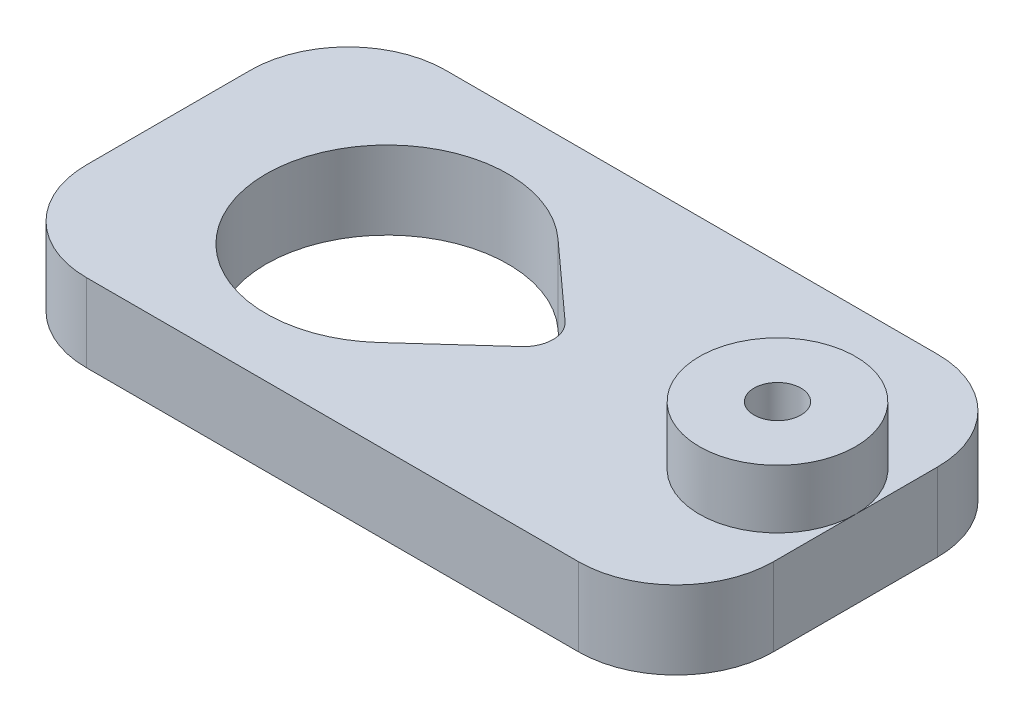
ISO-10303-21;
HEADER;
FILE_DESCRIPTION(('STEP AP214'),'2;1');
FILE_NAME('part.step','',(''),(''),'','','');
FILE_SCHEMA(('AUTOMOTIVE_DESIGN { 1 0 10303 214 1 1 1 1 }'));
ENDSEC;
DATA;
#1=APPLICATION_CONTEXT('core data for automotive mechanical design processes');
#2=APPLICATION_PROTOCOL_DEFINITION('international standard','automotive_design',2000,#1);
#3=PRODUCT_CONTEXT('',#1,'mechanical');
#4=PRODUCT('Part','Part','',(#3));
#5=PRODUCT_RELATED_PRODUCT_CATEGORY('part','',(#4));
#6=PRODUCT_DEFINITION_FORMATION('','',#4);
#7=PRODUCT_DEFINITION_CONTEXT('part definition',#1,'design');
#8=PRODUCT_DEFINITION('design','',#6,#7);
#9=PRODUCT_DEFINITION_SHAPE('','',#8);
#10=(LENGTH_UNIT() NAMED_UNIT(*) SI_UNIT(.MILLI.,.METRE.));
#11=(NAMED_UNIT(*) PLANE_ANGLE_UNIT() SI_UNIT($,.RADIAN.));
#12=(NAMED_UNIT(*) SI_UNIT($,.STERADIAN.) SOLID_ANGLE_UNIT());
#13=UNCERTAINTY_MEASURE_WITH_UNIT(LENGTH_MEASURE(1.E-05),#10,'distance_accuracy_value','');
#14=(GEOMETRIC_REPRESENTATION_CONTEXT(3) GLOBAL_UNCERTAINTY_ASSIGNED_CONTEXT((#13)) GLOBAL_UNIT_ASSIGNED_CONTEXT((#10,
#11,#12)) REPRESENTATION_CONTEXT('',''));
#15=CARTESIAN_POINT('',(0.,0.,0.));
#16=DIRECTION('',(0.,0.,1.));
#17=DIRECTION('',(1.,0.,0.));
#18=AXIS2_PLACEMENT_3D('',#15,#16,#17);
#19=CARTESIAN_POINT('',(24.,4.,0.));
#20=DIRECTION('',(1.,0.,0.));
#21=DIRECTION('',(0.,0.,-1.));
#22=AXIS2_PLACEMENT_3D('',#19,#20,#21);
#23=PLANE('',#22);
#24=DIRECTION('',(0.,0.,1.));
#25=VECTOR('',#24,1.);
#26=CARTESIAN_POINT('',(24.,0.,0.));
#27=LINE('',#26,#25);
#28=CARTESIAN_POINT('',(24.,0.,-4.2));
#29=VERTEX_POINT('',#28);
#30=CARTESIAN_POINT('',(24.,0.,4.2));
#31=VERTEX_POINT('',#30);
#32=EDGE_CURVE('E171',#29,#31,#27,.T.);
#33=ORIENTED_EDGE('',*,*,#32,.F.);
#34=DIRECTION('',(0.,-1.,0.));
#35=VECTOR('',#34,1.);
#36=CARTESIAN_POINT('',(24.,4.,-4.2));
#37=LINE('',#36,#35);
#38=CARTESIAN_POINT('',(24.,4.,-4.2));
#39=VERTEX_POINT('',#38);
#40=EDGE_CURVE('E136',#29,#39,#37,.F.);
#41=ORIENTED_EDGE('',*,*,#40,.T.);
#42=DIRECTION('',(0.,0.,1.));
#43=VECTOR('',#42,1.);
#44=CARTESIAN_POINT('',(24.,4.,0.));
#45=LINE('',#44,#43);
#46=CARTESIAN_POINT('',(24.,4.,0.));
#47=VERTEX_POINT('',#46);
#48=EDGE_CURVE('E129',#39,#47,#45,.T.);
#49=ORIENTED_EDGE('',*,*,#48,.T.);
#50=CARTESIAN_POINT('',(24.,4.,4.2));
#51=VERTEX_POINT('',#50);
#52=EDGE_CURVE('E133',#47,#51,#45,.T.);
#53=ORIENTED_EDGE('',*,*,#52,.T.);
#54=DIRECTION('',(0.,-1.,0.));
#55=VECTOR('',#54,1.);
#56=CARTESIAN_POINT('',(24.,0.,4.2));
#57=LINE('',#56,#55);
#58=EDGE_CURVE('E206',#51,#31,#57,.T.);
#59=ORIENTED_EDGE('',*,*,#58,.T.);
#60=EDGE_LOOP('',(#33,#41,#49,#53,#59));
#61=FACE_BOUND('',#60,.T.);
#62=ADVANCED_FACE('F36',(#61),#23,.T.);
#63=CARTESIAN_POINT('',(0.,4.,-9.2));
#64=DIRECTION('',(0.,0.,-1.));
#65=DIRECTION('',(-1.,0.,0.));
#66=AXIS2_PLACEMENT_3D('',#63,#64,#65);
#67=PLANE('',#66);
#68=DIRECTION('',(1.,0.,0.));
#69=VECTOR('',#68,1.);
#70=CARTESIAN_POINT('',(0.,4.,-9.2));
#71=LINE('',#70,#69);
#72=CARTESIAN_POINT('',(-6.2,4.,-9.2));
#73=VERTEX_POINT('',#72);
#74=CARTESIAN_POINT('',(19.,4.,-9.2));
#75=VERTEX_POINT('',#74);
#76=EDGE_CURVE('E139',#73,#75,#71,.T.);
#77=ORIENTED_EDGE('',*,*,#76,.T.);
#78=DIRECTION('',(0.,-1.,0.));
#79=VECTOR('',#78,1.);
#80=CARTESIAN_POINT('',(19.,4.,-9.2));
#81=LINE('',#80,#79);
#82=CARTESIAN_POINT('',(19.,0.,-9.2));
#83=VERTEX_POINT('',#82);
#84=EDGE_CURVE('E195',#75,#83,#81,.T.);
#85=ORIENTED_EDGE('',*,*,#84,.T.);
#86=DIRECTION('',(1.,0.,0.));
#87=VECTOR('',#86,1.);
#88=CARTESIAN_POINT('',(0.,0.,-9.2));
#89=LINE('',#88,#87);
#90=CARTESIAN_POINT('',(-6.2,0.,-9.2));
#91=VERTEX_POINT('',#90);
#92=EDGE_CURVE('E174',#91,#83,#89,.T.);
#93=ORIENTED_EDGE('',*,*,#92,.F.);
#94=DIRECTION('',(0.,-1.,0.));
#95=VECTOR('',#94,1.);
#96=CARTESIAN_POINT('',(-6.2,4.,-9.2));
#97=LINE('',#96,#95);
#98=EDGE_CURVE('E193',#91,#73,#97,.F.);
#99=ORIENTED_EDGE('',*,*,#98,.T.);
#100=EDGE_LOOP('',(#77,#85,#93,#99));
#101=FACE_BOUND('',#100,.T.);
#102=ADVANCED_FACE('F241',(#101),#67,.T.);
#103=CARTESIAN_POINT('',(-11.2,4.,0.));
#104=DIRECTION('',(1.,0.,0.));
#105=DIRECTION('',(0.,0.,-1.));
#106=AXIS2_PLACEMENT_3D('',#103,#104,#105);
#107=PLANE('',#106);
#108=DIRECTION('',(0.,0.,1.));
#109=VECTOR('',#108,1.);
#110=CARTESIAN_POINT('',(-11.2,0.,0.));
#111=LINE('',#110,#109);
#112=CARTESIAN_POINT('',(-11.2,0.,-4.2));
#113=VERTEX_POINT('',#112);
#114=CARTESIAN_POINT('',(-11.2,0.,4.2));
#115=VERTEX_POINT('',#114);
#116=EDGE_CURVE('E177',#113,#115,#111,.T.);
#117=ORIENTED_EDGE('',*,*,#116,.T.);
#118=DIRECTION('',(0.,-1.,0.));
#119=VECTOR('',#118,1.);
#120=CARTESIAN_POINT('',(-11.2,4.,4.2));
#121=LINE('',#120,#119);
#122=CARTESIAN_POINT('',(-11.2,4.,4.2));
#123=VERTEX_POINT('',#122);
#124=EDGE_CURVE('E11',#115,#123,#121,.F.);
#125=ORIENTED_EDGE('',*,*,#124,.T.);
#126=DIRECTION('',(0.,0.,1.));
#127=VECTOR('',#126,1.);
#128=CARTESIAN_POINT('',(-11.2,4.,0.));
#129=LINE('',#128,#127);
#130=CARTESIAN_POINT('',(-11.2,4.,-4.2));
#131=VERTEX_POINT('',#130);
#132=EDGE_CURVE('E153',#131,#123,#129,.T.);
#133=ORIENTED_EDGE('',*,*,#132,.F.);
#134=DIRECTION('',(0.,-1.,0.));
#135=VECTOR('',#134,1.);
#136=CARTESIAN_POINT('',(-11.2,0.,-4.2));
#137=LINE('',#136,#135);
#138=EDGE_CURVE('E44',#131,#113,#137,.T.);
#139=ORIENTED_EDGE('',*,*,#138,.T.);
#140=EDGE_LOOP('',(#117,#125,#133,#139));
#141=FACE_BOUND('',#140,.T.);
#142=ADVANCED_FACE('F223',(#141),#107,.F.);
#143=CARTESIAN_POINT('',(0.,4.,0.));
#144=DIRECTION('',(0.,-1.,0.));
#145=DIRECTION('',(0.,0.,-1.));
#146=AXIS2_PLACEMENT_3D('',#143,#144,#145);
#147=CYLINDRICAL_SURFACE('',#146,6.2);
#148=CARTESIAN_POINT('',(0.,0.,0.));
#149=DIRECTION('',(0.,1.,0.));
#150=DIRECTION('',(0.,0.,1.));
#151=AXIS2_PLACEMENT_3D('',#148,#149,#150);
#152=CIRCLE('',#151,6.2);
#153=CARTESIAN_POINT('',(4.16285714285714,0.,-4.59462951805293));
#154=VERTEX_POINT('',#153);
#155=CARTESIAN_POINT('',(4.16285714285714,0.,4.59462951805293));
#156=VERTEX_POINT('',#155);
#157=EDGE_CURVE('E158',#154,#156,#152,.T.);
#158=ORIENTED_EDGE('',*,*,#157,.F.);
#159=DIRECTION('',(0.,-1.,0.));
#160=VECTOR('',#159,1.);
#161=CARTESIAN_POINT('',(4.16285714285714,4.,-4.59462951805293));
#162=LINE('',#161,#160);
#163=CARTESIAN_POINT('',(4.16285714285714,4.,-4.59462951805293));
#164=VERTEX_POINT('',#163);
#165=EDGE_CURVE('E191',#164,#154,#162,.T.);
#166=ORIENTED_EDGE('',*,*,#165,.F.);
#167=CARTESIAN_POINT('',(0.,4.,0.));
#168=DIRECTION('',(0.,1.,0.));
#169=DIRECTION('',(0.,0.,1.));
#170=AXIS2_PLACEMENT_3D('',#167,#168,#169);
#171=CIRCLE('',#170,6.2);
#172=CARTESIAN_POINT('',(4.16285714285714,4.,4.59462951805293));
#173=VERTEX_POINT('',#172);
#174=EDGE_CURVE('E185',#164,#173,#171,.T.);
#175=ORIENTED_EDGE('',*,*,#174,.T.);
#176=DIRECTION('',(0.,-1.,0.));
#177=VECTOR('',#176,1.);
#178=CARTESIAN_POINT('',(4.16285714285714,4.,4.59462951805293));
#179=LINE('',#178,#177);
#180=EDGE_CURVE('E157',#173,#156,#179,.T.);
#181=ORIENTED_EDGE('',*,*,#180,.T.);
#182=EDGE_LOOP('',(#158,#166,#175,#181));
#183=FACE_BOUND('',#182,.T.);
#184=ADVANCED_FACE('F271',(#183),#147,.F.);
#185=CARTESIAN_POINT('',(4.16285714285714,4.,-4.59462951805293));
#186=DIRECTION('',(-0.671428571428571,0.,0.741069277105311));
#187=DIRECTION('',(0.741069277105311,0.,0.671428571428571));
#188=AXIS2_PLACEMENT_3D('',#185,#186,#187);
#189=PLANE('',#188);
#190=DIRECTION('',(-0.741069277105311,0.,-0.671428571428571));
#191=VECTOR('',#190,1.);
#192=CARTESIAN_POINT('',(4.16285714285714,0.,-4.59462951805293));
#193=LINE('',#192,#191);
#194=CARTESIAN_POINT('',(8.00714285714286,0.,-1.11160391565797));
#195=VERTEX_POINT('',#194);
#196=EDGE_CURVE('E161',#195,#154,#193,.T.);
#197=ORIENTED_EDGE('',*,*,#196,.F.);
#198=DIRECTION('',(0.,-1.,0.));
#199=VECTOR('',#198,1.);
#200=CARTESIAN_POINT('',(8.00714285714286,4.,-1.11160391565797));
#201=LINE('',#200,#199);
#202=CARTESIAN_POINT('',(8.00714285714286,4.,-1.11160391565797));
#203=VERTEX_POINT('',#202);
#204=EDGE_CURVE('E189',#203,#195,#201,.T.);
#205=ORIENTED_EDGE('',*,*,#204,.F.);
#206=DIRECTION('',(-0.741069277105311,0.,-0.671428571428571));
#207=VECTOR('',#206,1.);
#208=CARTESIAN_POINT('',(4.16285714285714,4.,-4.59462951805293));
#209=LINE('',#208,#207);
#210=EDGE_CURVE('E446',#203,#164,#209,.T.);
#211=ORIENTED_EDGE('',*,*,#210,.T.);
#212=ORIENTED_EDGE('',*,*,#165,.T.);
#213=EDGE_LOOP('',(#197,#205,#211,#212));
#214=FACE_BOUND('',#213,.T.);
#215=ADVANCED_FACE('F267',(#214),#189,.T.);
#216=CARTESIAN_POINT('',(7.,4.,0.));
#217=DIRECTION('',(0.,-1.,0.));
#218=DIRECTION('',(0.,0.,-1.));
#219=AXIS2_PLACEMENT_3D('',#216,#217,#218);
#220=CYLINDRICAL_SURFACE('',#219,1.5);
#221=CARTESIAN_POINT('',(7.,0.,0.));
#222=DIRECTION('',(0.,1.,0.));
#223=DIRECTION('',(0.,0.,1.));
#224=AXIS2_PLACEMENT_3D('',#221,#222,#223);
#225=CIRCLE('',#224,1.5);
#226=CARTESIAN_POINT('',(8.00714285714286,0.,1.11160391565797));
#227=VERTEX_POINT('',#226);
#228=EDGE_CURVE('E165',#227,#195,#225,.T.);
#229=ORIENTED_EDGE('',*,*,#228,.F.);
#230=DIRECTION('',(0.,-1.,0.));
#231=VECTOR('',#230,1.);
#232=CARTESIAN_POINT('',(8.00714285714286,4.,1.11160391565797));
#233=LINE('',#232,#231);
#234=CARTESIAN_POINT('',(8.00714285714286,4.,1.11160391565797));
#235=VERTEX_POINT('',#234);
#236=EDGE_CURVE('E187',#235,#227,#233,.T.);
#237=ORIENTED_EDGE('',*,*,#236,.F.);
#238=CARTESIAN_POINT('',(7.,4.,0.));
#239=DIRECTION('',(0.,1.,0.));
#240=DIRECTION('',(0.,0.,1.));
#241=AXIS2_PLACEMENT_3D('',#238,#239,#240);
#242=CIRCLE('',#241,1.5);
#243=EDGE_CURVE('E147',#235,#203,#242,.T.);
#244=ORIENTED_EDGE('',*,*,#243,.T.);
#245=ORIENTED_EDGE('',*,*,#204,.T.);
#246=EDGE_LOOP('',(#229,#237,#244,#245));
#247=FACE_BOUND('',#246,.T.);
#248=ADVANCED_FACE('F264',(#247),#220,.F.);
#249=CARTESIAN_POINT('',(0.,4.,9.2));
#250=DIRECTION('',(0.,0.,-1.));
#251=DIRECTION('',(-1.,0.,0.));
#252=AXIS2_PLACEMENT_3D('',#249,#250,#251);
#253=PLANE('',#252);
#254=DIRECTION('',(1.,0.,0.));
#255=VECTOR('',#254,1.);
#256=CARTESIAN_POINT('',(0.,4.,9.2));
#257=LINE('',#256,#255);
#258=CARTESIAN_POINT('',(-6.2,4.,9.2));
#259=VERTEX_POINT('',#258);
#260=CARTESIAN_POINT('',(19.,4.,9.2));
#261=VERTEX_POINT('',#260);
#262=EDGE_CURVE('E155',#259,#261,#257,.T.);
#263=ORIENTED_EDGE('',*,*,#262,.F.);
#264=DIRECTION('',(0.,-1.,0.));
#265=VECTOR('',#264,1.);
#266=CARTESIAN_POINT('',(-6.2,4.,9.2));
#267=LINE('',#266,#265);
#268=CARTESIAN_POINT('',(-6.2,0.,9.2));
#269=VERTEX_POINT('',#268);
#270=EDGE_CURVE('E216',#259,#269,#267,.T.);
#271=ORIENTED_EDGE('',*,*,#270,.T.);
#272=DIRECTION('',(1.,0.,0.));
#273=VECTOR('',#272,1.);
#274=CARTESIAN_POINT('',(0.,0.,9.2));
#275=LINE('',#274,#273);
#276=CARTESIAN_POINT('',(19.,0.,9.2));
#277=VERTEX_POINT('',#276);
#278=EDGE_CURVE('E180',#269,#277,#275,.T.);
#279=ORIENTED_EDGE('',*,*,#278,.T.);
#280=DIRECTION('',(0.,-1.,0.));
#281=VECTOR('',#280,1.);
#282=CARTESIAN_POINT('',(19.,4.,9.2));
#283=LINE('',#282,#281);
#284=EDGE_CURVE('E51',#277,#261,#283,.F.);
#285=ORIENTED_EDGE('',*,*,#284,.T.);
#286=EDGE_LOOP('',(#263,#271,#279,#285));
#287=FACE_BOUND('',#286,.T.);
#288=ADVANCED_FACE('F235',(#287),#253,.F.);
#289=CARTESIAN_POINT('',(4.16285714285714,4.,4.59462951805293));
#290=DIRECTION('',(0.671428571428571,0.,0.741069277105311));
#291=DIRECTION('',(0.741069277105311,0.,-0.671428571428571));
#292=AXIS2_PLACEMENT_3D('',#289,#290,#291);
#293=PLANE('',#292);
#294=DIRECTION('',(-0.741069277105311,0.,0.671428571428571));
#295=VECTOR('',#294,1.);
#296=CARTESIAN_POINT('',(4.16285714285714,0.,4.59462951805293));
#297=LINE('',#296,#295);
#298=EDGE_CURVE('E168',#227,#156,#297,.T.);
#299=ORIENTED_EDGE('',*,*,#298,.T.);
#300=ORIENTED_EDGE('',*,*,#180,.F.);
#301=DIRECTION('',(-0.741069277105311,0.,0.671428571428571));
#302=VECTOR('',#301,1.);
#303=CARTESIAN_POINT('',(4.16285714285714,4.,4.59462951805293));
#304=LINE('',#303,#302);
#305=EDGE_CURVE('E146',#235,#173,#304,.T.);
#306=ORIENTED_EDGE('',*,*,#305,.F.);
#307=ORIENTED_EDGE('',*,*,#236,.T.);
#308=EDGE_LOOP('',(#299,#300,#306,#307));
#309=FACE_BOUND('',#308,.T.);
#310=ADVANCED_FACE('F259',(#309),#293,.F.);
#311=CARTESIAN_POINT('',(20.,4.,0.));
#312=DIRECTION('',(0.,-1.,0.));
#313=DIRECTION('',(0.,0.,-1.));
#314=AXIS2_PLACEMENT_3D('',#311,#312,#313);
#315=CYLINDRICAL_SURFACE('',#314,1.2);
#316=CARTESIAN_POINT('',(20.,0.,0.));
#317=DIRECTION('',(0.,1.,0.));
#318=DIRECTION('',(0.,0.,1.));
#319=AXIS2_PLACEMENT_3D('',#316,#317,#318);
#320=CIRCLE('',#319,1.2);
#321=CARTESIAN_POINT('',(20.,0.,1.2));
#322=VERTEX_POINT('',#321);
#323=EDGE_CURVE('E182',#322,#322,#320,.T.);
#324=ORIENTED_EDGE('',*,*,#323,.F.);
#325=EDGE_LOOP('',(#324));
#326=FACE_BOUND('',#325,.T.);
#327=CARTESIAN_POINT('',(20.,7.,0.));
#328=DIRECTION('',(0.,1.,0.));
#329=DIRECTION('',(0.,0.,1.));
#330=AXIS2_PLACEMENT_3D('',#327,#328,#329);
#331=CIRCLE('',#330,1.2);
#332=CARTESIAN_POINT('',(20.,7.,1.2));
#333=VERTEX_POINT('',#332);
#334=EDGE_CURVE('E437',#333,#333,#331,.T.);
#335=ORIENTED_EDGE('',*,*,#334,.T.);
#336=EDGE_LOOP('',(#335));
#337=FACE_BOUND('',#336,.T.);
#338=ADVANCED_FACE('F262',(#326,#337),#315,.F.);
#339=CARTESIAN_POINT('',(0.,4.,0.));
#340=DIRECTION('',(0.,1.,0.));
#341=DIRECTION('',(0.,0.,1.));
#342=AXIS2_PLACEMENT_3D('',#339,#340,#341);
#343=PLANE('',#342);
#344=ORIENTED_EDGE('',*,*,#174,.F.);
#345=ORIENTED_EDGE('',*,*,#210,.F.);
#346=ORIENTED_EDGE('',*,*,#243,.F.);
#347=ORIENTED_EDGE('',*,*,#305,.T.);
#348=EDGE_LOOP('',(#344,#345,#346,#347));
#349=FACE_BOUND('',#348,.T.);
#350=ORIENTED_EDGE('',*,*,#48,.F.);
#351=CARTESIAN_POINT('',(19.,4.,-4.2));
#352=DIRECTION('',(0.,1.,0.));
#353=DIRECTION('',(0.,0.,1.));
#354=AXIS2_PLACEMENT_3D('',#351,#352,#353);
#355=CIRCLE('',#354,5.);
#356=EDGE_CURVE('E213',#39,#75,#355,.T.);
#357=ORIENTED_EDGE('',*,*,#356,.T.);
#358=ORIENTED_EDGE('',*,*,#76,.F.);
#359=CARTESIAN_POINT('',(-6.2,4.,-4.2));
#360=DIRECTION('',(0.,1.,0.));
#361=DIRECTION('',(0.,0.,1.));
#362=AXIS2_PLACEMENT_3D('',#359,#360,#361);
#363=CIRCLE('',#362,5.);
#364=EDGE_CURVE('E210',#73,#131,#363,.T.);
#365=ORIENTED_EDGE('',*,*,#364,.T.);
#366=ORIENTED_EDGE('',*,*,#132,.T.);
#367=CARTESIAN_POINT('',(-6.2,4.,4.2));
#368=DIRECTION('',(0.,1.,0.));
#369=DIRECTION('',(0.,0.,1.));
#370=AXIS2_PLACEMENT_3D('',#367,#368,#369);
#371=CIRCLE('',#370,5.);
#372=EDGE_CURVE('E58',#123,#259,#371,.T.);
#373=ORIENTED_EDGE('',*,*,#372,.T.);
#374=ORIENTED_EDGE('',*,*,#262,.T.);
#375=CARTESIAN_POINT('',(19.,4.,4.2));
#376=DIRECTION('',(0.,1.,0.));
#377=DIRECTION('',(0.,0.,1.));
#378=AXIS2_PLACEMENT_3D('',#375,#376,#377);
#379=CIRCLE('',#378,5.);
#380=EDGE_CURVE('E145',#261,#51,#379,.T.);
#381=ORIENTED_EDGE('',*,*,#380,.T.);
#382=ORIENTED_EDGE('',*,*,#52,.F.);
#383=CARTESIAN_POINT('',(20.,4.,0.));
#384=DIRECTION('',(0.,1.,0.));
#385=DIRECTION('',(0.,0.,1.));
#386=AXIS2_PLACEMENT_3D('',#383,#384,#385);
#387=CIRCLE('',#386,4.);
#388=EDGE_CURVE('E143',#47,#47,#387,.T.);
#389=ORIENTED_EDGE('',*,*,#388,.F.);
#390=EDGE_LOOP('',(#350,#357,#358,#365,#366,#373,#374,#381,#382,#389));
#391=FACE_BOUND('',#390,.T.);
#392=ADVANCED_FACE('F141',(#349,#391),#343,.T.);
#393=CARTESIAN_POINT('',(0.,0.,0.));
#394=DIRECTION('',(0.,1.,0.));
#395=DIRECTION('',(0.,0.,1.));
#396=AXIS2_PLACEMENT_3D('',#393,#394,#395);
#397=PLANE('',#396);
#398=ORIENTED_EDGE('',*,*,#157,.T.);
#399=ORIENTED_EDGE('',*,*,#298,.F.);
#400=ORIENTED_EDGE('',*,*,#228,.T.);
#401=ORIENTED_EDGE('',*,*,#196,.T.);
#402=EDGE_LOOP('',(#398,#399,#400,#401));
#403=FACE_BOUND('',#402,.T.);
#404=ORIENTED_EDGE('',*,*,#92,.T.);
#405=CARTESIAN_POINT('',(19.,0.,-4.2));
#406=DIRECTION('',(0.,1.,0.));
#407=DIRECTION('',(0.,0.,1.));
#408=AXIS2_PLACEMENT_3D('',#405,#406,#407);
#409=CIRCLE('',#408,5.);
#410=EDGE_CURVE('E204',#83,#29,#409,.F.);
#411=ORIENTED_EDGE('',*,*,#410,.T.);
#412=ORIENTED_EDGE('',*,*,#32,.T.);
#413=CARTESIAN_POINT('',(19.,0.,4.2));
#414=DIRECTION('',(0.,1.,0.));
#415=DIRECTION('',(0.,0.,1.));
#416=AXIS2_PLACEMENT_3D('',#413,#414,#415);
#417=CIRCLE('',#416,5.);
#418=EDGE_CURVE('E198',#31,#277,#417,.F.);
#419=ORIENTED_EDGE('',*,*,#418,.T.);
#420=ORIENTED_EDGE('',*,*,#278,.F.);
#421=CARTESIAN_POINT('',(-6.2,0.,4.2));
#422=DIRECTION('',(0.,1.,0.));
#423=DIRECTION('',(0.,0.,1.));
#424=AXIS2_PLACEMENT_3D('',#421,#422,#423);
#425=CIRCLE('',#424,5.);
#426=EDGE_CURVE('E202',#269,#115,#425,.F.);
#427=ORIENTED_EDGE('',*,*,#426,.T.);
#428=ORIENTED_EDGE('',*,*,#116,.F.);
#429=CARTESIAN_POINT('',(-6.2,0.,-4.2));
#430=DIRECTION('',(0.,1.,0.));
#431=DIRECTION('',(0.,0.,1.));
#432=AXIS2_PLACEMENT_3D('',#429,#430,#431);
#433=CIRCLE('',#432,5.);
#434=EDGE_CURVE('E200',#113,#91,#433,.F.);
#435=ORIENTED_EDGE('',*,*,#434,.T.);
#436=EDGE_LOOP('',(#404,#411,#412,#419,#420,#427,#428,#435));
#437=FACE_BOUND('',#436,.T.);
#438=ORIENTED_EDGE('',*,*,#323,.T.);
#439=EDGE_LOOP('',(#438));
#440=FACE_BOUND('',#439,.T.);
#441=ADVANCED_FACE('F228',(#403,#437,#440),#397,.F.);
#442=CARTESIAN_POINT('',(20.,7.,0.));
#443=DIRECTION('',(0.,1.,0.));
#444=DIRECTION('',(0.,0.,1.));
#445=AXIS2_PLACEMENT_3D('',#442,#443,#444);
#446=PLANE('',#445);
#447=CARTESIAN_POINT('',(20.,7.,0.));
#448=DIRECTION('',(0.,1.,0.));
#449=DIRECTION('',(0.,0.,1.));
#450=AXIS2_PLACEMENT_3D('',#447,#448,#449);
#451=CIRCLE('',#450,4.);
#452=CARTESIAN_POINT('',(20.,7.,4.));
#453=VERTEX_POINT('',#452);
#454=EDGE_CURVE('E162',#453,#453,#451,.T.);
#455=ORIENTED_EDGE('',*,*,#454,.T.);
#456=EDGE_LOOP('',(#455));
#457=FACE_BOUND('',#456,.T.);
#458=ORIENTED_EDGE('',*,*,#334,.F.);
#459=EDGE_LOOP('',(#458));
#460=FACE_BOUND('',#459,.T.);
#461=ADVANCED_FACE('F281',(#457,#460),#446,.T.);
#462=CARTESIAN_POINT('',(20.,7.,0.));
#463=DIRECTION('',(0.,-1.,0.));
#464=DIRECTION('',(0.,0.,-1.));
#465=AXIS2_PLACEMENT_3D('',#462,#463,#464);
#466=CYLINDRICAL_SURFACE('',#465,4.);
#467=ORIENTED_EDGE('',*,*,#454,.F.);
#468=EDGE_LOOP('',(#467));
#469=FACE_BOUND('',#468,.T.);
#470=ORIENTED_EDGE('',*,*,#388,.T.);
#471=EDGE_LOOP('',(#470));
#472=FACE_BOUND('',#471,.T.);
#473=ADVANCED_FACE('F277',(#469,#472),#466,.T.);
#474=CARTESIAN_POINT('',(19.,4.,-4.2));
#475=DIRECTION('',(0.,-1.,0.));
#476=DIRECTION('',(0.,0.,-1.));
#477=AXIS2_PLACEMENT_3D('',#474,#475,#476);
#478=CYLINDRICAL_SURFACE('',#477,5.);
#479=ORIENTED_EDGE('',*,*,#356,.F.);
#480=ORIENTED_EDGE('',*,*,#40,.F.);
#481=ORIENTED_EDGE('',*,*,#410,.F.);
#482=ORIENTED_EDGE('',*,*,#84,.F.);
#483=EDGE_LOOP('',(#479,#480,#481,#482));
#484=FACE_BOUND('',#483,.T.);
#485=ADVANCED_FACE('F239',(#484),#478,.T.);
#486=CARTESIAN_POINT('',(-6.2,4.,4.2));
#487=DIRECTION('',(0.,-1.,0.));
#488=DIRECTION('',(0.,0.,-1.));
#489=AXIS2_PLACEMENT_3D('',#486,#487,#488);
#490=CYLINDRICAL_SURFACE('',#489,5.);
#491=ORIENTED_EDGE('',*,*,#372,.F.);
#492=ORIENTED_EDGE('',*,*,#124,.F.);
#493=ORIENTED_EDGE('',*,*,#426,.F.);
#494=ORIENTED_EDGE('',*,*,#270,.F.);
#495=EDGE_LOOP('',(#491,#492,#493,#494));
#496=FACE_BOUND('',#495,.T.);
#497=ADVANCED_FACE('F234',(#496),#490,.T.);
#498=CARTESIAN_POINT('',(-6.2,4.,-4.2));
#499=DIRECTION('',(0.,1.,0.));
#500=DIRECTION('',(0.,0.,1.));
#501=AXIS2_PLACEMENT_3D('',#498,#499,#500);
#502=CYLINDRICAL_SURFACE('',#501,5.);
#503=ORIENTED_EDGE('',*,*,#364,.F.);
#504=ORIENTED_EDGE('',*,*,#98,.F.);
#505=ORIENTED_EDGE('',*,*,#434,.F.);
#506=ORIENTED_EDGE('',*,*,#138,.F.);
#507=EDGE_LOOP('',(#503,#504,#505,#506));
#508=FACE_BOUND('',#507,.T.);
#509=ADVANCED_FACE('F244',(#508),#502,.T.);
#510=CARTESIAN_POINT('',(19.,4.,4.2));
#511=DIRECTION('',(0.,1.,0.));
#512=DIRECTION('',(0.,0.,1.));
#513=AXIS2_PLACEMENT_3D('',#510,#511,#512);
#514=CYLINDRICAL_SURFACE('',#513,5.);
#515=ORIENTED_EDGE('',*,*,#380,.F.);
#516=ORIENTED_EDGE('',*,*,#284,.F.);
#517=ORIENTED_EDGE('',*,*,#418,.F.);
#518=ORIENTED_EDGE('',*,*,#58,.F.);
#519=EDGE_LOOP('',(#515,#516,#517,#518));
#520=FACE_BOUND('',#519,.T.);
#521=ADVANCED_FACE('F38',(#520),#514,.T.);
#522=CLOSED_SHELL('',(#62,#102,#142,#184,#215,#248,#288,#310,#338,#392,#441,#461,#473,#485,#497,
#509,#521));
#523=MANIFOLD_SOLID_BREP('B2',#522);
#524=ADVANCED_BREP_SHAPE_REPRESENTATION('',(#18,#523),#14);
#525=SHAPE_DEFINITION_REPRESENTATION(#9,#524);
ENDSEC;
END-ISO-10303-21;
